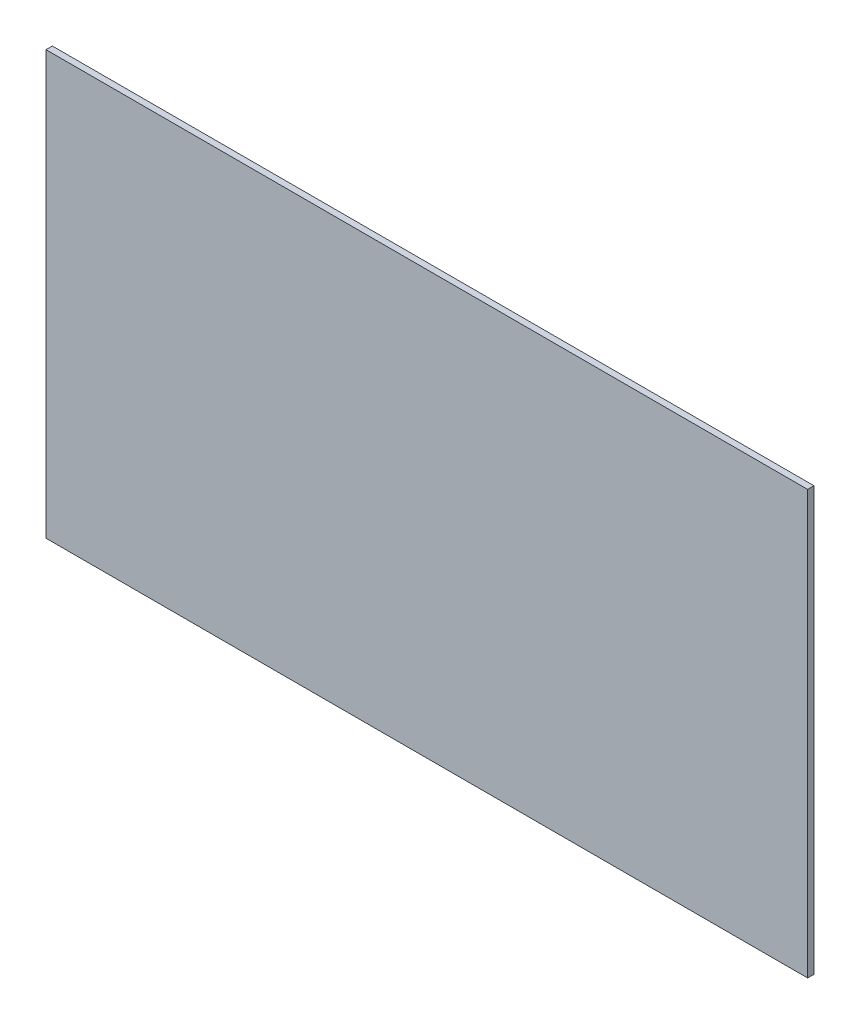
ISO-10303-21;
HEADER;
FILE_DESCRIPTION(('STEP AP214'),'2;1');
FILE_NAME('part.step','',(''),(''),'','','');
FILE_SCHEMA(('AUTOMOTIVE_DESIGN { 1 0 10303 214 1 1 1 1 }'));
ENDSEC;
DATA;
#1=APPLICATION_CONTEXT('core data for automotive mechanical design processes');
#2=APPLICATION_PROTOCOL_DEFINITION('international standard','automotive_design',2000,#1);
#3=PRODUCT_CONTEXT('',#1,'mechanical');
#4=PRODUCT('Part','Part','',(#3));
#5=PRODUCT_RELATED_PRODUCT_CATEGORY('part','',(#4));
#6=PRODUCT_DEFINITION_FORMATION('','',#4);
#7=PRODUCT_DEFINITION_CONTEXT('part definition',#1,'design');
#8=PRODUCT_DEFINITION('design','',#6,#7);
#9=PRODUCT_DEFINITION_SHAPE('','',#8);
#10=(LENGTH_UNIT() NAMED_UNIT(*) SI_UNIT(.MILLI.,.METRE.));
#11=(NAMED_UNIT(*) PLANE_ANGLE_UNIT() SI_UNIT($,.RADIAN.));
#12=(NAMED_UNIT(*) SI_UNIT($,.STERADIAN.) SOLID_ANGLE_UNIT());
#13=UNCERTAINTY_MEASURE_WITH_UNIT(LENGTH_MEASURE(1.E-05),#10,'distance_accuracy_value','');
#14=(GEOMETRIC_REPRESENTATION_CONTEXT(3) GLOBAL_UNCERTAINTY_ASSIGNED_CONTEXT((#13)) GLOBAL_UNIT_ASSIGNED_CONTEXT((#10,
#11,#12)) REPRESENTATION_CONTEXT('',''));
#15=CARTESIAN_POINT('',(0.,0.,0.));
#16=DIRECTION('',(0.,0.,1.));
#17=DIRECTION('',(1.,0.,0.));
#18=AXIS2_PLACEMENT_3D('',#15,#16,#17);
#19=CARTESIAN_POINT('',(-120.790388535526,56.4971751412429,1.5));
#20=DIRECTION('',(1.,0.,0.));
#21=DIRECTION('',(0.,0.,-1.));
#22=AXIS2_PLACEMENT_3D('',#19,#20,#21);
#23=PLANE('',#22);
#24=DIRECTION('',(0.,-1.,0.));
#25=VECTOR('',#24,1.);
#26=CARTESIAN_POINT('',(-120.790388535526,56.4971751412429,0.));
#27=LINE('',#26,#25);
#28=CARTESIAN_POINT('',(-120.790388535526,56.4971751412429,0.));
#29=VERTEX_POINT('',#28);
#30=CARTESIAN_POINT('',(-120.790388535526,-43.5028248587571,0.));
#31=VERTEX_POINT('',#30);
#32=EDGE_CURVE('E107',#29,#31,#27,.T.);
#33=ORIENTED_EDGE('',*,*,#32,.T.);
#34=DIRECTION('',(0.,0.,-1.));
#35=VECTOR('',#34,1.);
#36=CARTESIAN_POINT('',(-120.790388535526,-43.5028248587571,1.5));
#37=LINE('',#36,#35);
#38=CARTESIAN_POINT('',(-120.790388535526,-43.5028248587571,1.5));
#39=VERTEX_POINT('',#38);
#40=EDGE_CURVE('E11',#39,#31,#37,.T.);
#41=ORIENTED_EDGE('',*,*,#40,.F.);
#42=DIRECTION('',(0.,-1.,0.));
#43=VECTOR('',#42,1.);
#44=CARTESIAN_POINT('',(-120.790388535526,56.4971751412429,1.5));
#45=LINE('',#44,#43);
#46=CARTESIAN_POINT('',(-120.790388535526,56.4971751412429,1.5));
#47=VERTEX_POINT('',#46);
#48=EDGE_CURVE('E91',#47,#39,#45,.T.);
#49=ORIENTED_EDGE('',*,*,#48,.F.);
#50=DIRECTION('',(0.,0.,-1.));
#51=VECTOR('',#50,1.);
#52=CARTESIAN_POINT('',(-120.790388535526,56.4971751412429,1.5));
#53=LINE('',#52,#51);
#54=EDGE_CURVE('E103',#47,#29,#53,.T.);
#55=ORIENTED_EDGE('',*,*,#54,.T.);
#56=EDGE_LOOP('',(#33,#41,#49,#55));
#57=FACE_BOUND('',#56,.T.);
#58=ADVANCED_FACE('F39',(#57),#23,.F.);
#59=CARTESIAN_POINT('',(-120.790388535526,-43.5028248587571,1.5));
#60=DIRECTION('',(0.,1.,0.));
#61=DIRECTION('',(0.,0.,1.));
#62=AXIS2_PLACEMENT_3D('',#59,#60,#61);
#63=PLANE('',#62);
#64=DIRECTION('',(1.,0.,0.));
#65=VECTOR('',#64,1.);
#66=CARTESIAN_POINT('',(-120.790388535526,-43.5028248587571,0.));
#67=LINE('',#66,#65);
#68=CARTESIAN_POINT('',(59.2096114644738,-43.5028248587571,0.));
#69=VERTEX_POINT('',#68);
#70=EDGE_CURVE('E96',#31,#69,#67,.T.);
#71=ORIENTED_EDGE('',*,*,#70,.T.);
#72=DIRECTION('',(0.,0.,-1.));
#73=VECTOR('',#72,1.);
#74=CARTESIAN_POINT('',(59.2096114644738,-43.5028248587571,1.5));
#75=LINE('',#74,#73);
#76=CARTESIAN_POINT('',(59.2096114644738,-43.5028248587571,1.5));
#77=VERTEX_POINT('',#76);
#78=EDGE_CURVE('E48',#77,#69,#75,.T.);
#79=ORIENTED_EDGE('',*,*,#78,.F.);
#80=DIRECTION('',(1.,0.,0.));
#81=VECTOR('',#80,1.);
#82=CARTESIAN_POINT('',(-120.790388535526,-43.5028248587571,1.5));
#83=LINE('',#82,#81);
#84=EDGE_CURVE('E86',#39,#77,#83,.T.);
#85=ORIENTED_EDGE('',*,*,#84,.F.);
#86=ORIENTED_EDGE('',*,*,#40,.T.);
#87=EDGE_LOOP('',(#71,#79,#85,#86));
#88=FACE_BOUND('',#87,.T.);
#89=ADVANCED_FACE('F95',(#88),#63,.F.);
#90=CARTESIAN_POINT('',(59.2096114644738,56.4971751412429,1.5));
#91=DIRECTION('',(-1.,0.,0.));
#92=DIRECTION('',(0.,0.,1.));
#93=AXIS2_PLACEMENT_3D('',#90,#91,#92);
#94=PLANE('',#93);
#95=DIRECTION('',(0.,1.,0.));
#96=VECTOR('',#95,1.);
#97=CARTESIAN_POINT('',(59.2096114644738,56.4971751412429,0.));
#98=LINE('',#97,#96);
#99=CARTESIAN_POINT('',(59.2096114644738,56.4971751412429,0.));
#100=VERTEX_POINT('',#99);
#101=EDGE_CURVE('E73',#69,#100,#98,.T.);
#102=ORIENTED_EDGE('',*,*,#101,.T.);
#103=DIRECTION('',(0.,0.,-1.));
#104=VECTOR('',#103,1.);
#105=CARTESIAN_POINT('',(59.2096114644738,56.4971751412429,1.5));
#106=LINE('',#105,#104);
#107=CARTESIAN_POINT('',(59.2096114644738,56.4971751412429,1.5));
#108=VERTEX_POINT('',#107);
#109=EDGE_CURVE('E98',#108,#100,#106,.T.);
#110=ORIENTED_EDGE('',*,*,#109,.F.);
#111=DIRECTION('',(0.,1.,0.));
#112=VECTOR('',#111,1.);
#113=CARTESIAN_POINT('',(59.2096114644738,56.4971751412429,1.5));
#114=LINE('',#113,#112);
#115=EDGE_CURVE('E89',#77,#108,#114,.T.);
#116=ORIENTED_EDGE('',*,*,#115,.F.);
#117=ORIENTED_EDGE('',*,*,#78,.T.);
#118=EDGE_LOOP('',(#102,#110,#116,#117));
#119=FACE_BOUND('',#118,.T.);
#120=ADVANCED_FACE('F99',(#119),#94,.F.);
#121=CARTESIAN_POINT('',(-120.790388535526,56.4971751412429,1.5));
#122=DIRECTION('',(0.,-1.,0.));
#123=DIRECTION('',(0.,0.,-1.));
#124=AXIS2_PLACEMENT_3D('',#121,#122,#123);
#125=PLANE('',#124);
#126=DIRECTION('',(-1.,0.,0.));
#127=VECTOR('',#126,1.);
#128=CARTESIAN_POINT('',(-120.790388535526,56.4971751412429,0.));
#129=LINE('',#128,#127);
#130=EDGE_CURVE('E79',#100,#29,#129,.T.);
#131=ORIENTED_EDGE('',*,*,#130,.T.);
#132=ORIENTED_EDGE('',*,*,#54,.F.);
#133=DIRECTION('',(-1.,0.,0.));
#134=VECTOR('',#133,1.);
#135=CARTESIAN_POINT('',(-120.790388535526,56.4971751412429,1.5));
#136=LINE('',#135,#134);
#137=EDGE_CURVE('E56',#108,#47,#136,.T.);
#138=ORIENTED_EDGE('',*,*,#137,.F.);
#139=ORIENTED_EDGE('',*,*,#109,.T.);
#140=EDGE_LOOP('',(#131,#132,#138,#139));
#141=FACE_BOUND('',#140,.T.);
#142=ADVANCED_FACE('F120',(#141),#125,.F.);
#143=CARTESIAN_POINT('',(0.,0.,1.5));
#144=DIRECTION('',(0.,0.,1.));
#145=DIRECTION('',(1.,0.,0.));
#146=AXIS2_PLACEMENT_3D('',#143,#144,#145);
#147=PLANE('',#146);
#148=ORIENTED_EDGE('',*,*,#48,.T.);
#149=ORIENTED_EDGE('',*,*,#84,.T.);
#150=ORIENTED_EDGE('',*,*,#115,.T.);
#151=ORIENTED_EDGE('',*,*,#137,.T.);
#152=EDGE_LOOP('',(#148,#149,#150,#151));
#153=FACE_BOUND('',#152,.T.);
#154=ADVANCED_FACE('F87',(#153),#147,.T.);
#155=CARTESIAN_POINT('',(0.,0.,0.));
#156=DIRECTION('',(0.,0.,1.));
#157=DIRECTION('',(1.,0.,0.));
#158=AXIS2_PLACEMENT_3D('',#155,#156,#157);
#159=PLANE('',#158);
#160=ORIENTED_EDGE('',*,*,#32,.F.);
#161=ORIENTED_EDGE('',*,*,#130,.F.);
#162=ORIENTED_EDGE('',*,*,#101,.F.);
#163=ORIENTED_EDGE('',*,*,#70,.F.);
#164=EDGE_LOOP('',(#160,#161,#162,#163));
#165=FACE_BOUND('',#164,.T.);
#166=ADVANCED_FACE('F123',(#165),#159,.F.);
#167=CLOSED_SHELL('',(#58,#89,#120,#142,#154,#166));
#168=MANIFOLD_SOLID_BREP('B2',#167);
#169=ADVANCED_BREP_SHAPE_REPRESENTATION('',(#18,#168),#14);
#170=SHAPE_DEFINITION_REPRESENTATION(#9,#169);
ENDSEC;
END-ISO-10303-21;
